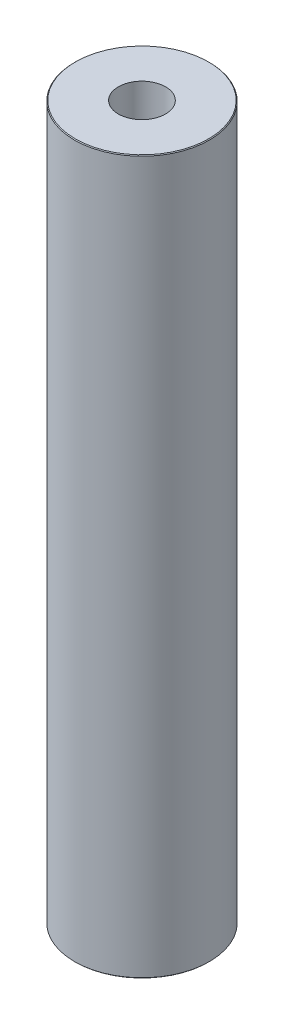
ISO-10303-21;
HEADER;
FILE_DESCRIPTION(('STEP AP214'),'2;1');
FILE_NAME('part.step','',(''),(''),'','','');
FILE_SCHEMA(('AUTOMOTIVE_DESIGN { 1 0 10303 214 1 1 1 1 }'));
ENDSEC;
DATA;
#1=APPLICATION_CONTEXT('core data for automotive mechanical design processes');
#2=APPLICATION_PROTOCOL_DEFINITION('international standard','automotive_design',2000,#1);
#3=PRODUCT_CONTEXT('',#1,'mechanical');
#4=PRODUCT('Part','Part','',(#3));
#5=PRODUCT_RELATED_PRODUCT_CATEGORY('part','',(#4));
#6=PRODUCT_DEFINITION_FORMATION('','',#4);
#7=PRODUCT_DEFINITION_CONTEXT('part definition',#1,'design');
#8=PRODUCT_DEFINITION('design','',#6,#7);
#9=PRODUCT_DEFINITION_SHAPE('','',#8);
#10=(LENGTH_UNIT() NAMED_UNIT(*) SI_UNIT(.MILLI.,.METRE.));
#11=(NAMED_UNIT(*) PLANE_ANGLE_UNIT() SI_UNIT($,.RADIAN.));
#12=(NAMED_UNIT(*) SI_UNIT($,.STERADIAN.) SOLID_ANGLE_UNIT());
#13=UNCERTAINTY_MEASURE_WITH_UNIT(LENGTH_MEASURE(1.E-05),#10,'distance_accuracy_value','');
#14=(GEOMETRIC_REPRESENTATION_CONTEXT(3) GLOBAL_UNCERTAINTY_ASSIGNED_CONTEXT((#13)) GLOBAL_UNIT_ASSIGNED_CONTEXT((#10,
#11,#12)) REPRESENTATION_CONTEXT('',''));
#15=CARTESIAN_POINT('',(0.,0.,0.));
#16=DIRECTION('',(0.,0.,1.));
#17=DIRECTION('',(1.,0.,0.));
#18=AXIS2_PLACEMENT_3D('',#15,#16,#17);
#19=CARTESIAN_POINT('',(0.,449.673299339918,0.));
#20=DIRECTION('',(0.,-1.,0.));
#21=DIRECTION('',(0.,0.,-1.));
#22=AXIS2_PLACEMENT_3D('',#19,#20,#21);
#23=CYLINDRICAL_SURFACE('',#22,42.5);
#24=CARTESIAN_POINT('',(0.,449.206659852716,0.));
#25=DIRECTION('',(0.,1.,0.));
#26=DIRECTION('',(0.,0.,1.));
#27=AXIS2_PLACEMENT_3D('',#24,#25,#26);
#28=CIRCLE('',#27,42.5);
#29=CARTESIAN_POINT('',(0.,449.206659852716,42.5));
#30=VERTEX_POINT('',#29);
#31=EDGE_CURVE('E50',#30,#30,#28,.F.);
#32=ORIENTED_EDGE('',*,*,#31,.T.);
#33=EDGE_LOOP('',(#32));
#34=FACE_BOUND('',#33,.T.);
#35=CARTESIAN_POINT('',(0.,0.466639487202103,0.));
#36=DIRECTION('',(0.,1.,0.));
#37=DIRECTION('',(0.,0.,1.));
#38=AXIS2_PLACEMENT_3D('',#35,#36,#37);
#39=CIRCLE('',#38,42.5);
#40=CARTESIAN_POINT('',(0.,0.466639487202103,42.5));
#41=VERTEX_POINT('',#40);
#42=EDGE_CURVE('E51',#41,#41,#39,.T.);
#43=ORIENTED_EDGE('',*,*,#42,.T.);
#44=EDGE_LOOP('',(#43));
#45=FACE_BOUND('',#44,.T.);
#46=ADVANCED_FACE('F39',(#34,#45),#23,.T.);
#47=CARTESIAN_POINT('',(0.,449.673299339918,0.));
#48=DIRECTION('',(0.,1.,0.));
#49=DIRECTION('',(0.,0.,1.));
#50=AXIS2_PLACEMENT_3D('',#47,#48,#49);
#51=PLANE('',#50);
#52=CARTESIAN_POINT('',(0.,449.673299339918,0.));
#53=DIRECTION('',(0.,1.,0.));
#54=DIRECTION('',(0.,0.,1.));
#55=AXIS2_PLACEMENT_3D('',#52,#53,#54);
#56=CIRCLE('',#55,42.0333605127979);
#57=CARTESIAN_POINT('',(0.,449.673299339918,42.0333605127979));
#58=VERTEX_POINT('',#57);
#59=EDGE_CURVE('E54',#58,#58,#56,.T.);
#60=ORIENTED_EDGE('',*,*,#59,.T.);
#61=EDGE_LOOP('',(#60));
#62=FACE_BOUND('',#61,.T.);
#63=CARTESIAN_POINT('',(0.,449.673299339918,0.));
#64=DIRECTION('',(0.,1.,0.));
#65=DIRECTION('',(0.,0.,1.));
#66=AXIS2_PLACEMENT_3D('',#63,#64,#65);
#67=CIRCLE('',#66,14.8943807487826);
#68=CARTESIAN_POINT('',(0.,449.673299339918,14.8943807487826));
#69=VERTEX_POINT('',#68);
#70=EDGE_CURVE('E58',#69,#69,#67,.T.);
#71=ORIENTED_EDGE('',*,*,#70,.F.);
#72=EDGE_LOOP('',(#71));
#73=FACE_BOUND('',#72,.T.);
#74=ADVANCED_FACE('F69',(#62,#73),#51,.T.);
#75=CARTESIAN_POINT('',(0.,0.,0.));
#76=DIRECTION('',(0.,1.,0.));
#77=DIRECTION('',(0.,0.,1.));
#78=AXIS2_PLACEMENT_3D('',#75,#76,#77);
#79=PLANE('',#78);
#80=CARTESIAN_POINT('',(0.,0.,0.));
#81=DIRECTION('',(0.,1.,0.));
#82=DIRECTION('',(0.,0.,1.));
#83=AXIS2_PLACEMENT_3D('',#80,#81,#82);
#84=CIRCLE('',#83,42.0333605127979);
#85=CARTESIAN_POINT('',(0.,0.,42.0333605127979));
#86=VERTEX_POINT('',#85);
#87=EDGE_CURVE('E10',#86,#86,#84,.F.);
#88=ORIENTED_EDGE('',*,*,#87,.T.);
#89=EDGE_LOOP('',(#88));
#90=FACE_BOUND('',#89,.T.);
#91=CARTESIAN_POINT('',(0.,0.,0.));
#92=DIRECTION('',(0.,1.,0.));
#93=DIRECTION('',(0.,0.,1.));
#94=AXIS2_PLACEMENT_3D('',#91,#92,#93);
#95=CIRCLE('',#94,14.8943807487826);
#96=CARTESIAN_POINT('',(0.,0.,14.8943807487826));
#97=VERTEX_POINT('',#96);
#98=EDGE_CURVE('E63',#97,#97,#95,.T.);
#99=ORIENTED_EDGE('',*,*,#98,.T.);
#100=EDGE_LOOP('',(#99));
#101=FACE_BOUND('',#100,.T.);
#102=ADVANCED_FACE('F75',(#90,#101),#79,.F.);
#103=CARTESIAN_POINT('',(0.,449.673299339918,0.));
#104=DIRECTION('',(0.,-1.,0.));
#105=DIRECTION('',(0.,0.,-1.));
#106=AXIS2_PLACEMENT_3D('',#103,#104,#105);
#107=CYLINDRICAL_SURFACE('',#106,14.8943807487826);
#108=ORIENTED_EDGE('',*,*,#70,.T.);
#109=EDGE_LOOP('',(#108));
#110=FACE_BOUND('',#109,.T.);
#111=ORIENTED_EDGE('',*,*,#98,.F.);
#112=EDGE_LOOP('',(#111));
#113=FACE_BOUND('',#112,.T.);
#114=ADVANCED_FACE('F70',(#110,#113),#107,.F.);
#115=CARTESIAN_POINT('',(0.,449.673299339918,0.));
#116=DIRECTION('',(0.,-1.,0.));
#117=DIRECTION('',(0.,0.,-1.));
#118=AXIS2_PLACEMENT_3D('',#115,#116,#117);
#119=CONICAL_SURFACE('',#118,42.0333605127979,0.785398163397478);
#120=ORIENTED_EDGE('',*,*,#31,.F.);
#121=EDGE_LOOP('',(#120));
#122=FACE_BOUND('',#121,.T.);
#123=ORIENTED_EDGE('',*,*,#59,.F.);
#124=EDGE_LOOP('',(#123));
#125=FACE_BOUND('',#124,.T.);
#126=ADVANCED_FACE('F81',(#122,#125),#119,.T.);
#127=CARTESIAN_POINT('',(0.,0.466639487202103,0.));
#128=DIRECTION('',(0.,1.,0.));
#129=DIRECTION('',(0.,0.,1.));
#130=AXIS2_PLACEMENT_3D('',#127,#128,#129);
#131=CONICAL_SURFACE('',#130,42.5,0.785398163397419);
#132=ORIENTED_EDGE('',*,*,#87,.F.);
#133=EDGE_LOOP('',(#132));
#134=FACE_BOUND('',#133,.T.);
#135=ORIENTED_EDGE('',*,*,#42,.F.);
#136=EDGE_LOOP('',(#135));
#137=FACE_BOUND('',#136,.T.);
#138=ADVANCED_FACE('F45',(#134,#137),#131,.T.);
#139=CLOSED_SHELL('',(#46,#74,#102,#114,#126,#138));
#140=MANIFOLD_SOLID_BREP('B2',#139);
#141=ADVANCED_BREP_SHAPE_REPRESENTATION('',(#18,#140),#14);
#142=SHAPE_DEFINITION_REPRESENTATION(#9,#141);
ENDSEC;
END-ISO-10303-21;
